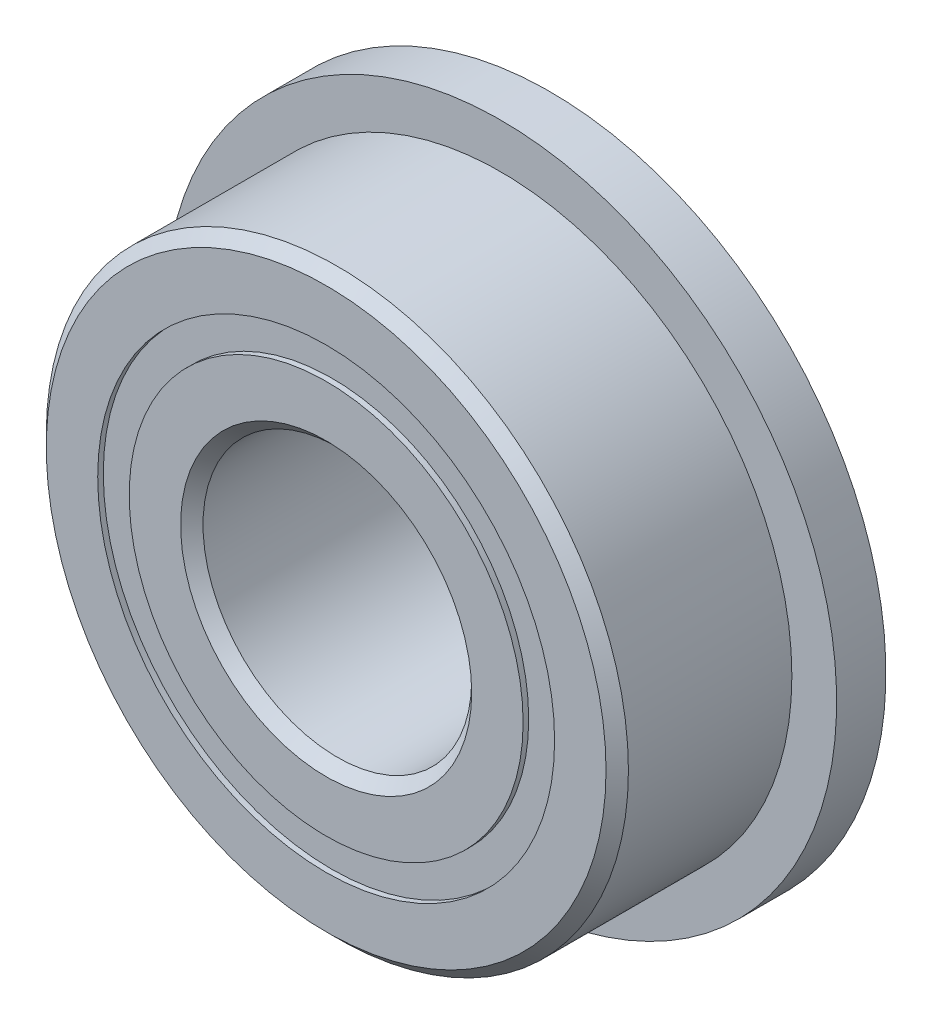
ISO-10303-21;
HEADER;
FILE_DESCRIPTION(('STEP AP214'),'2;1');
FILE_NAME('part.step','',(''),(''),'','','');
FILE_SCHEMA(('AUTOMOTIVE_DESIGN { 1 0 10303 214 1 1 1 1 }'));
ENDSEC;
DATA;
#1=APPLICATION_CONTEXT('core data for automotive mechanical design processes');
#2=APPLICATION_PROTOCOL_DEFINITION('international standard','automotive_design',2000,#1);
#3=PRODUCT_CONTEXT('',#1,'mechanical');
#4=PRODUCT('Part','Part','',(#3));
#5=PRODUCT_RELATED_PRODUCT_CATEGORY('part','',(#4));
#6=PRODUCT_DEFINITION_FORMATION('','',#4);
#7=PRODUCT_DEFINITION_CONTEXT('part definition',#1,'design');
#8=PRODUCT_DEFINITION('design','',#6,#7);
#9=PRODUCT_DEFINITION_SHAPE('','',#8);
#10=(LENGTH_UNIT() NAMED_UNIT(*) SI_UNIT(.MILLI.,.METRE.));
#11=(NAMED_UNIT(*) PLANE_ANGLE_UNIT() SI_UNIT($,.RADIAN.));
#12=(NAMED_UNIT(*) SI_UNIT($,.STERADIAN.) SOLID_ANGLE_UNIT());
#13=UNCERTAINTY_MEASURE_WITH_UNIT(LENGTH_MEASURE(1.E-05),#10,'distance_accuracy_value','');
#14=(GEOMETRIC_REPRESENTATION_CONTEXT(3) GLOBAL_UNCERTAINTY_ASSIGNED_CONTEXT((#13)) GLOBAL_UNIT_ASSIGNED_CONTEXT((#10,
#11,#12)) REPRESENTATION_CONTEXT('',''));
#15=CARTESIAN_POINT('',(0.,0.,0.));
#16=DIRECTION('',(0.,0.,1.));
#17=DIRECTION('',(1.,0.,0.));
#18=AXIS2_PLACEMENT_3D('',#15,#16,#17);
#19=CARTESIAN_POINT('',(0.,5.10164835164835,-2.375));
#20=DIRECTION('',(0.,0.,1.));
#21=DIRECTION('',(1.,0.,0.));
#22=AXIS2_PLACEMENT_3D('',#19,#20,#21);
#23=PLANE('',#22);
#24=CARTESIAN_POINT('',(0.,0.,-2.375));
#25=DIRECTION('',(0.,0.,1.));
#26=DIRECTION('',(1.,0.,0.));
#27=AXIS2_PLACEMENT_3D('',#24,#25,#26);
#28=CIRCLE('',#27,5.10164835164835);
#29=CARTESIAN_POINT('',(5.10164835164835,0.,-2.375));
#30=VERTEX_POINT('',#29);
#31=EDGE_CURVE('E57',#30,#30,#28,.T.);
#32=ORIENTED_EDGE('',*,*,#31,.F.);
#33=EDGE_LOOP('',(#32));
#34=FACE_BOUND('',#33,.T.);
#35=CARTESIAN_POINT('',(0.,0.,-2.375));
#36=DIRECTION('',(0.,0.,1.));
#37=DIRECTION('',(1.,0.,0.));
#38=AXIS2_PLACEMENT_3D('',#35,#36,#37);
#39=CIRCLE('',#38,4.39835164835165);
#40=CARTESIAN_POINT('',(4.39835164835165,0.,-2.375));
#41=VERTEX_POINT('',#40);
#42=EDGE_CURVE('E11',#41,#41,#39,.T.);
#43=ORIENTED_EDGE('',*,*,#42,.T.);
#44=EDGE_LOOP('',(#43));
#45=FACE_BOUND('',#44,.T.);
#46=ADVANCED_FACE('F43',(#34,#45),#23,.F.);
#47=CARTESIAN_POINT('',(0.,0.,2.5));
#48=DIRECTION('',(0.,0.,1.));
#49=DIRECTION('',(1.,0.,0.));
#50=AXIS2_PLACEMENT_3D('',#47,#48,#49);
#51=CYLINDRICAL_SURFACE('',#50,4.39835164835165);
#52=ORIENTED_EDGE('',*,*,#42,.F.);
#53=EDGE_LOOP('',(#52));
#54=FACE_BOUND('',#53,.T.);
#55=CARTESIAN_POINT('',(0.,0.,-1.16542887575844));
#56=DIRECTION('',(0.,0.,1.));
#57=DIRECTION('',(1.,0.,0.));
#58=AXIS2_PLACEMENT_3D('',#55,#56,#57);
#59=CIRCLE('',#58,4.39835164835165);
#60=CARTESIAN_POINT('',(4.39835164835165,0.,-1.16542887575844));
#61=VERTEX_POINT('',#60);
#62=EDGE_CURVE('E49',#61,#61,#59,.T.);
#63=ORIENTED_EDGE('',*,*,#62,.T.);
#64=EDGE_LOOP('',(#63));
#65=FACE_BOUND('',#64,.T.);
#66=ADVANCED_FACE('F66',(#54,#65),#51,.F.);
#67=CARTESIAN_POINT('',(0.,5.10164835164835,-1.16542887575844));
#68=DIRECTION('',(0.,0.,-1.));
#69=DIRECTION('',(-1.,0.,0.));
#70=AXIS2_PLACEMENT_3D('',#67,#68,#69);
#71=PLANE('',#70);
#72=ORIENTED_EDGE('',*,*,#62,.F.);
#73=EDGE_LOOP('',(#72));
#74=FACE_BOUND('',#73,.T.);
#75=CARTESIAN_POINT('',(0.,0.,-1.16542887575844));
#76=DIRECTION('',(0.,0.,1.));
#77=DIRECTION('',(1.,0.,0.));
#78=AXIS2_PLACEMENT_3D('',#75,#76,#77);
#79=CIRCLE('',#78,5.10164835164835);
#80=CARTESIAN_POINT('',(5.10164835164835,0.,-1.16542887575844));
#81=VERTEX_POINT('',#80);
#82=EDGE_CURVE('E53',#81,#81,#79,.T.);
#83=ORIENTED_EDGE('',*,*,#82,.T.);
#84=EDGE_LOOP('',(#83));
#85=FACE_BOUND('',#84,.T.);
#86=ADVANCED_FACE('F70',(#74,#85),#71,.F.);
#87=CARTESIAN_POINT('',(0.,0.,2.5));
#88=DIRECTION('',(0.,0.,1.));
#89=DIRECTION('',(1.,0.,0.));
#90=AXIS2_PLACEMENT_3D('',#87,#88,#89);
#91=CYLINDRICAL_SURFACE('',#90,5.10164835164835);
#92=ORIENTED_EDGE('',*,*,#82,.F.);
#93=EDGE_LOOP('',(#92));
#94=FACE_BOUND('',#93,.T.);
#95=ORIENTED_EDGE('',*,*,#31,.T.);
#96=EDGE_LOOP('',(#95));
#97=FACE_BOUND('',#96,.T.);
#98=ADVANCED_FACE('F63',(#94,#97),#91,.T.);
#99=CLOSED_SHELL('',(#46,#66,#86,#98));
#100=MANIFOLD_SOLID_BREP('B2',#99);
#101=CARTESIAN_POINT('',(0.,5.10164835164835,2.375));
#102=DIRECTION('',(0.,0.,-1.));
#103=DIRECTION('',(-1.,0.,0.));
#104=AXIS2_PLACEMENT_3D('',#101,#102,#103);
#105=PLANE('',#104);
#106=CARTESIAN_POINT('',(0.,0.,2.375));
#107=DIRECTION('',(0.,0.,1.));
#108=DIRECTION('',(1.,0.,0.));
#109=AXIS2_PLACEMENT_3D('',#106,#107,#108);
#110=CIRCLE('',#109,4.39835164835165);
#111=CARTESIAN_POINT('',(4.39835164835165,0.,2.375));
#112=VERTEX_POINT('',#111);
#113=EDGE_CURVE('E42',#112,#112,#110,.T.);
#114=ORIENTED_EDGE('',*,*,#113,.F.);
#115=EDGE_LOOP('',(#114));
#116=FACE_BOUND('',#115,.T.);
#117=CARTESIAN_POINT('',(0.,0.,2.375));
#118=DIRECTION('',(0.,0.,1.));
#119=DIRECTION('',(1.,0.,0.));
#120=AXIS2_PLACEMENT_3D('',#117,#118,#119);
#121=CIRCLE('',#120,5.10164835164835);
#122=CARTESIAN_POINT('',(5.10164835164835,0.,2.375));
#123=VERTEX_POINT('',#122);
#124=EDGE_CURVE('E124',#123,#123,#121,.T.);
#125=ORIENTED_EDGE('',*,*,#124,.T.);
#126=EDGE_LOOP('',(#125));
#127=FACE_BOUND('',#126,.T.);
#128=ADVANCED_FACE('F110',(#116,#127),#105,.F.);
#129=CARTESIAN_POINT('',(0.,0.,2.5));
#130=DIRECTION('',(0.,0.,1.));
#131=DIRECTION('',(1.,0.,0.));
#132=AXIS2_PLACEMENT_3D('',#129,#130,#131);
#133=CYLINDRICAL_SURFACE('',#132,4.39835164835165);
#134=CARTESIAN_POINT('',(0.,0.,1.16542887575844));
#135=DIRECTION('',(0.,0.,1.));
#136=DIRECTION('',(1.,0.,0.));
#137=AXIS2_PLACEMENT_3D('',#134,#135,#136);
#138=CIRCLE('',#137,4.39835164835165);
#139=CARTESIAN_POINT('',(4.39835164835165,0.,1.16542887575844));
#140=VERTEX_POINT('',#139);
#141=EDGE_CURVE('E116',#140,#140,#138,.T.);
#142=ORIENTED_EDGE('',*,*,#141,.F.);
#143=EDGE_LOOP('',(#142));
#144=FACE_BOUND('',#143,.T.);
#145=ORIENTED_EDGE('',*,*,#113,.T.);
#146=EDGE_LOOP('',(#145));
#147=FACE_BOUND('',#146,.T.);
#148=ADVANCED_FACE('F139',(#144,#147),#133,.F.);
#149=CARTESIAN_POINT('',(0.,5.10164835164835,1.16542887575844));
#150=DIRECTION('',(0.,0.,1.));
#151=DIRECTION('',(1.,0.,0.));
#152=AXIS2_PLACEMENT_3D('',#149,#150,#151);
#153=PLANE('',#152);
#154=CARTESIAN_POINT('',(0.,0.,1.16542887575844));
#155=DIRECTION('',(0.,0.,1.));
#156=DIRECTION('',(1.,0.,0.));
#157=AXIS2_PLACEMENT_3D('',#154,#155,#156);
#158=CIRCLE('',#157,5.10164835164835);
#159=CARTESIAN_POINT('',(5.10164835164835,0.,1.16542887575844));
#160=VERTEX_POINT('',#159);
#161=EDGE_CURVE('E120',#160,#160,#158,.T.);
#162=ORIENTED_EDGE('',*,*,#161,.F.);
#163=EDGE_LOOP('',(#162));
#164=FACE_BOUND('',#163,.T.);
#165=ORIENTED_EDGE('',*,*,#141,.T.);
#166=EDGE_LOOP('',(#165));
#167=FACE_BOUND('',#166,.T.);
#168=ADVANCED_FACE('F134',(#164,#167),#153,.F.);
#169=CARTESIAN_POINT('',(0.,0.,2.5));
#170=DIRECTION('',(0.,0.,1.));
#171=DIRECTION('',(1.,0.,0.));
#172=AXIS2_PLACEMENT_3D('',#169,#170,#171);
#173=CYLINDRICAL_SURFACE('',#172,5.10164835164835);
#174=ORIENTED_EDGE('',*,*,#124,.F.);
#175=EDGE_LOOP('',(#174));
#176=FACE_BOUND('',#175,.T.);
#177=ORIENTED_EDGE('',*,*,#161,.T.);
#178=EDGE_LOOP('',(#177));
#179=FACE_BOUND('',#178,.T.);
#180=ADVANCED_FACE('F131',(#176,#179),#173,.T.);
#181=CLOSED_SHELL('',(#128,#148,#168,#180));
#182=MANIFOLD_SOLID_BREP('B6',#181);
#183=CARTESIAN_POINT('',(-2.37499999999995,4.11362066797611,0.));
#184=DIRECTION('',(0.,0.,1.));
#185=DIRECTION('',(-0.499999999999989,0.866025403784445,0.));
#186=AXIS2_PLACEMENT_3D('',#183,#184,#185);
#187=SPHERICAL_SURFACE('',#186,1.16542887575844);
#188=CARTESIAN_POINT('',(-2.37499999999995,4.11362066797611,1.16542887575843));
#189=VERTEX_POINT('',#188);
#190=VERTEX_LOOP('',#189);
#191=FACE_BOUND('',#190,.T.);
#192=ADVANCED_FACE('F177',(#191),#187,.T.);
#193=CLOSED_SHELL('',(#192));
#194=MANIFOLD_SOLID_BREP('B37',#193);
#195=CARTESIAN_POINT('',(-4.11362066797606,2.37500000000005,0.));
#196=DIRECTION('',(0.,0.,1.));
#197=DIRECTION('',(-0.866025403784433,0.50000000000001,0.));
#198=AXIS2_PLACEMENT_3D('',#195,#196,#197);
#199=SPHERICAL_SURFACE('',#198,1.16542887575844);
#200=CARTESIAN_POINT('',(-4.11362066797606,2.37500000000005,1.16542887575843));
#201=VERTEX_POINT('',#200);
#202=VERTEX_LOOP('',#201);
#203=FACE_BOUND('',#202,.T.);
#204=ADVANCED_FACE('F197',(#203),#199,.T.);
#205=CLOSED_SHELL('',(#204));
#206=MANIFOLD_SOLID_BREP('B106',#205);
#207=CARTESIAN_POINT('',(-4.75,0.,0.));
#208=DIRECTION('',(0.,0.,1.));
#209=DIRECTION('',(-1.,0.,0.));
#210=AXIS2_PLACEMENT_3D('',#207,#208,#209);
#211=SPHERICAL_SURFACE('',#210,1.16542887575844);
#212=CARTESIAN_POINT('',(-4.75,0.,1.16542887575843));
#213=VERTEX_POINT('',#212);
#214=VERTEX_LOOP('',#213);
#215=FACE_BOUND('',#214,.T.);
#216=ADVANCED_FACE('F217',(#215),#211,.T.);
#217=CLOSED_SHELL('',(#216));
#218=MANIFOLD_SOLID_BREP('B173',#217);
#219=CARTESIAN_POINT('',(-4.1136206679761,-2.37499999999996,0.));
#220=DIRECTION('',(0.,0.,1.));
#221=DIRECTION('',(-0.866025403784443,-0.499999999999992,0.));
#222=AXIS2_PLACEMENT_3D('',#219,#220,#221);
#223=SPHERICAL_SURFACE('',#222,1.16542887575844);
#224=CARTESIAN_POINT('',(-4.1136206679761,-2.37499999999996,1.16542887575843));
#225=VERTEX_POINT('',#224);
#226=VERTEX_LOOP('',#225);
#227=FACE_BOUND('',#226,.T.);
#228=ADVANCED_FACE('F237',(#227),#223,.T.);
#229=CLOSED_SHELL('',(#228));
#230=MANIFOLD_SOLID_BREP('B193',#229);
#231=CARTESIAN_POINT('',(-2.37500000000003,-4.11362066797606,0.));
#232=DIRECTION('',(0.,0.,1.));
#233=DIRECTION('',(-0.500000000000007,-0.866025403784435,0.));
#234=AXIS2_PLACEMENT_3D('',#231,#232,#233);
#235=SPHERICAL_SURFACE('',#234,1.16542887575844);
#236=CARTESIAN_POINT('',(-2.37500000000003,-4.11362066797606,1.16542887575843));
#237=VERTEX_POINT('',#236);
#238=VERTEX_LOOP('',#237);
#239=FACE_BOUND('',#238,.T.);
#240=ADVANCED_FACE('F257',(#239),#235,.T.);
#241=CLOSED_SHELL('',(#240));
#242=MANIFOLD_SOLID_BREP('B213',#241);
#243=CARTESIAN_POINT('',(0.,-4.75,0.));
#244=DIRECTION('',(0.,0.,1.));
#245=DIRECTION('',(0.,-1.,0.));
#246=AXIS2_PLACEMENT_3D('',#243,#244,#245);
#247=SPHERICAL_SURFACE('',#246,1.16542887575844);
#248=CARTESIAN_POINT('',(0.,-4.75,1.16542887575843));
#249=VERTEX_POINT('',#248);
#250=VERTEX_LOOP('',#249);
#251=FACE_BOUND('',#250,.T.);
#252=ADVANCED_FACE('F277',(#251),#247,.T.);
#253=CLOSED_SHELL('',(#252));
#254=MANIFOLD_SOLID_BREP('B233',#253);
#255=CARTESIAN_POINT('',(2.37499999999998,-4.1136206679761,0.));
#256=DIRECTION('',(0.,0.,1.));
#257=DIRECTION('',(0.499999999999995,-0.866025403784442,0.));
#258=AXIS2_PLACEMENT_3D('',#255,#256,#257);
#259=SPHERICAL_SURFACE('',#258,1.16542887575844);
#260=CARTESIAN_POINT('',(2.37499999999998,-4.1136206679761,1.16542887575843));
#261=VERTEX_POINT('',#260);
#262=VERTEX_LOOP('',#261);
#263=FACE_BOUND('',#262,.T.);
#264=ADVANCED_FACE('F297',(#263),#259,.T.);
#265=CLOSED_SHELL('',(#264));
#266=MANIFOLD_SOLID_BREP('B253',#265);
#267=CARTESIAN_POINT('',(4.11362066797607,-2.37500000000002,0.));
#268=DIRECTION('',(0.,0.,1.));
#269=DIRECTION('',(0.866025403784436,-0.500000000000004,0.));
#270=AXIS2_PLACEMENT_3D('',#267,#268,#269);
#271=SPHERICAL_SURFACE('',#270,1.16542887575844);
#272=CARTESIAN_POINT('',(4.11362066797607,-2.37500000000002,1.16542887575843));
#273=VERTEX_POINT('',#272);
#274=VERTEX_LOOP('',#273);
#275=FACE_BOUND('',#274,.T.);
#276=ADVANCED_FACE('F317',(#275),#271,.T.);
#277=CLOSED_SHELL('',(#276));
#278=MANIFOLD_SOLID_BREP('B273',#277);
#279=CARTESIAN_POINT('',(4.75,0.,0.));
#280=DIRECTION('',(0.,0.,1.));
#281=DIRECTION('',(1.,0.,0.));
#282=AXIS2_PLACEMENT_3D('',#279,#280,#281);
#283=SPHERICAL_SURFACE('',#282,1.16542887575844);
#284=CARTESIAN_POINT('',(4.75,0.,1.16542887575843));
#285=VERTEX_POINT('',#284);
#286=VERTEX_LOOP('',#285);
#287=FACE_BOUND('',#286,.T.);
#288=ADVANCED_FACE('F337',(#287),#283,.T.);
#289=CLOSED_SHELL('',(#288));
#290=MANIFOLD_SOLID_BREP('B293',#289);
#291=CARTESIAN_POINT('',(4.11362066797609,2.37499999999999,0.));
#292=DIRECTION('',(0.,0.,1.));
#293=DIRECTION('',(0.86602540378444,0.499999999999998,0.));
#294=AXIS2_PLACEMENT_3D('',#291,#292,#293);
#295=SPHERICAL_SURFACE('',#294,1.16542887575844);
#296=CARTESIAN_POINT('',(4.11362066797609,2.37499999999999,1.16542887575843));
#297=VERTEX_POINT('',#296);
#298=VERTEX_LOOP('',#297);
#299=FACE_BOUND('',#298,.T.);
#300=ADVANCED_FACE('F357',(#299),#295,.T.);
#301=CLOSED_SHELL('',(#300));
#302=MANIFOLD_SOLID_BREP('B313',#301);
#303=CARTESIAN_POINT('',(2.375,4.11362066797608,0.));
#304=DIRECTION('',(0.,0.,1.));
#305=DIRECTION('',(0.500000000000001,0.866025403784438,0.));
#306=AXIS2_PLACEMENT_3D('',#303,#304,#305);
#307=SPHERICAL_SURFACE('',#306,1.16542887575844);
#308=CARTESIAN_POINT('',(2.375,4.11362066797608,1.16542887575843));
#309=VERTEX_POINT('',#308);
#310=VERTEX_LOOP('',#309);
#311=FACE_BOUND('',#310,.T.);
#312=ADVANCED_FACE('F377',(#311),#307,.T.);
#313=CLOSED_SHELL('',(#312));
#314=MANIFOLD_SOLID_BREP('B333',#313);
#315=CARTESIAN_POINT('',(0.,4.75,0.));
#316=DIRECTION('',(0.,0.,1.));
#317=DIRECTION('',(0.,1.,0.));
#318=AXIS2_PLACEMENT_3D('',#315,#316,#317);
#319=SPHERICAL_SURFACE('',#318,1.16542887575844);
#320=CARTESIAN_POINT('',(0.,4.75,1.16542887575843));
#321=VERTEX_POINT('',#320);
#322=VERTEX_LOOP('',#321);
#323=FACE_BOUND('',#322,.T.);
#324=ADVANCED_FACE('F399',(#323),#319,.T.);
#325=CLOSED_SHELL('',(#324));
#326=MANIFOLD_SOLID_BREP('B353',#325);
#327=CARTESIAN_POINT('',(0.,4.39835164835165,2.5));
#328=DIRECTION('',(0.,0.,-1.));
#329=DIRECTION('',(-1.,0.,0.));
#330=AXIS2_PLACEMENT_3D('',#327,#328,#329);
#331=PLANE('',#330);
#332=CARTESIAN_POINT('',(0.,0.,2.5));
#333=DIRECTION('',(0.,0.,1.));
#334=DIRECTION('',(1.,0.,0.));
#335=AXIS2_PLACEMENT_3D('',#332,#333,#334);
#336=CIRCLE('',#335,3.25);
#337=CARTESIAN_POINT('',(3.25,0.,2.5));
#338=VERTEX_POINT('',#337);
#339=EDGE_CURVE('E446',#338,#338,#336,.T.);
#340=ORIENTED_EDGE('',*,*,#339,.F.);
#341=EDGE_LOOP('',(#340));
#342=FACE_BOUND('',#341,.T.);
#343=CARTESIAN_POINT('',(0.,0.,2.5));
#344=DIRECTION('',(0.,0.,1.));
#345=DIRECTION('',(1.,0.,0.));
#346=AXIS2_PLACEMENT_3D('',#343,#344,#345);
#347=CIRCLE('',#346,4.39835164835165);
#348=CARTESIAN_POINT('',(4.39835164835165,0.,2.5));
#349=VERTEX_POINT('',#348);
#350=EDGE_CURVE('E398',#349,#349,#347,.T.);
#351=ORIENTED_EDGE('',*,*,#350,.T.);
#352=EDGE_LOOP('',(#351));
#353=FACE_BOUND('',#352,.T.);
#354=ADVANCED_FACE('F418',(#342,#353),#331,.F.);
#355=CARTESIAN_POINT('',(0.,0.,2.5));
#356=DIRECTION('',(0.,0.,1.));
#357=DIRECTION('',(1.,0.,0.));
#358=AXIS2_PLACEMENT_3D('',#355,#356,#357);
#359=CYLINDRICAL_SURFACE('',#358,4.39835164835165);
#360=ORIENTED_EDGE('',*,*,#350,.F.);
#361=EDGE_LOOP('',(#360));
#362=FACE_BOUND('',#361,.T.);
#363=CARTESIAN_POINT('',(0.,0.,1.11111111111111));
#364=DIRECTION('',(0.,0.,1.));
#365=DIRECTION('',(1.,0.,0.));
#366=AXIS2_PLACEMENT_3D('',#363,#364,#365);
#367=CIRCLE('',#366,4.39835164835165);
#368=CARTESIAN_POINT('',(4.39835164835165,0.,1.11111111111111));
#369=VERTEX_POINT('',#368);
#370=EDGE_CURVE('E424',#369,#369,#367,.T.);
#371=ORIENTED_EDGE('',*,*,#370,.T.);
#372=EDGE_LOOP('',(#371));
#373=FACE_BOUND('',#372,.T.);
#374=ADVANCED_FACE('F453',(#362,#373),#359,.T.);
#375=CARTESIAN_POINT('',(0.,0.,0.));
#376=DIRECTION('',(0.,0.,1.));
#377=DIRECTION('',(1.,0.,0.));
#378=AXIS2_PLACEMENT_3D('',#375,#376,#377);
#379=TOROIDAL_SURFACE('',#378,4.75,1.16542887575843);
#380=ORIENTED_EDGE('',*,*,#370,.F.);
#381=EDGE_LOOP('',(#380));
#382=FACE_BOUND('',#381,.T.);
#383=CARTESIAN_POINT('',(0.,0.,-1.11111111111111));
#384=DIRECTION('',(0.,0.,1.));
#385=DIRECTION('',(1.,0.,0.));
#386=AXIS2_PLACEMENT_3D('',#383,#384,#385);
#387=CIRCLE('',#386,4.39835164835165);
#388=CARTESIAN_POINT('',(4.39835164835165,0.,-1.11111111111111));
#389=VERTEX_POINT('',#388);
#390=EDGE_CURVE('E428',#389,#389,#387,.T.);
#391=ORIENTED_EDGE('',*,*,#390,.T.);
#392=EDGE_LOOP('',(#391));
#393=FACE_BOUND('',#392,.T.);
#394=ADVANCED_FACE('F457',(#382,#393),#379,.F.);
#395=CARTESIAN_POINT('',(0.,0.,2.5));
#396=DIRECTION('',(0.,0.,1.));
#397=DIRECTION('',(1.,0.,0.));
#398=AXIS2_PLACEMENT_3D('',#395,#396,#397);
#399=CYLINDRICAL_SURFACE('',#398,4.39835164835165);
#400=ORIENTED_EDGE('',*,*,#390,.F.);
#401=EDGE_LOOP('',(#400));
#402=FACE_BOUND('',#401,.T.);
#403=CARTESIAN_POINT('',(0.,0.,-2.5));
#404=DIRECTION('',(0.,0.,1.));
#405=DIRECTION('',(1.,0.,0.));
#406=AXIS2_PLACEMENT_3D('',#403,#404,#405);
#407=CIRCLE('',#406,4.39835164835165);
#408=CARTESIAN_POINT('',(4.39835164835165,0.,-2.5));
#409=VERTEX_POINT('',#408);
#410=EDGE_CURVE('E432',#409,#409,#407,.T.);
#411=ORIENTED_EDGE('',*,*,#410,.T.);
#412=EDGE_LOOP('',(#411));
#413=FACE_BOUND('',#412,.T.);
#414=ADVANCED_FACE('F462',(#402,#413),#399,.T.);
#415=CARTESIAN_POINT('',(0.,3.25,-2.5));
#416=DIRECTION('',(0.,0.,1.));
#417=DIRECTION('',(1.,0.,0.));
#418=AXIS2_PLACEMENT_3D('',#415,#416,#417);
#419=PLANE('',#418);
#420=ORIENTED_EDGE('',*,*,#410,.F.);
#421=EDGE_LOOP('',(#420));
#422=FACE_BOUND('',#421,.T.);
#423=CARTESIAN_POINT('',(0.,0.,-2.5));
#424=DIRECTION('',(0.,0.,1.));
#425=DIRECTION('',(1.,0.,0.));
#426=AXIS2_PLACEMENT_3D('',#423,#424,#425);
#427=CIRCLE('',#426,3.25);
#428=CARTESIAN_POINT('',(3.25,0.,-2.5));
#429=VERTEX_POINT('',#428);
#430=EDGE_CURVE('E437',#429,#429,#427,.T.);
#431=ORIENTED_EDGE('',*,*,#430,.T.);
#432=EDGE_LOOP('',(#431));
#433=FACE_BOUND('',#432,.T.);
#434=ADVANCED_FACE('F468',(#422,#433),#419,.F.);
#435=CARTESIAN_POINT('',(0.,0.,-2.25));
#436=DIRECTION('',(0.,0.,-1.));
#437=DIRECTION('',(-1.,0.,0.));
#438=AXIS2_PLACEMENT_3D('',#435,#436,#437);
#439=CONICAL_SURFACE('',#438,3.,0.785398163397442);
#440=ORIENTED_EDGE('',*,*,#430,.F.);
#441=EDGE_LOOP('',(#440));
#442=FACE_BOUND('',#441,.T.);
#443=CARTESIAN_POINT('',(0.,0.,-2.25));
#444=DIRECTION('',(0.,0.,1.));
#445=DIRECTION('',(1.,0.,0.));
#446=AXIS2_PLACEMENT_3D('',#443,#444,#445);
#447=CIRCLE('',#446,3.);
#448=CARTESIAN_POINT('',(3.,0.,-2.25));
#449=VERTEX_POINT('',#448);
#450=EDGE_CURVE('E440',#449,#449,#447,.T.);
#451=ORIENTED_EDGE('',*,*,#450,.T.);
#452=EDGE_LOOP('',(#451));
#453=FACE_BOUND('',#452,.T.);
#454=ADVANCED_FACE('F472',(#442,#453),#439,.F.);
#455=CARTESIAN_POINT('',(0.,0.,2.5));
#456=DIRECTION('',(0.,0.,1.));
#457=DIRECTION('',(1.,0.,0.));
#458=AXIS2_PLACEMENT_3D('',#455,#456,#457);
#459=CYLINDRICAL_SURFACE('',#458,3.);
#460=ORIENTED_EDGE('',*,*,#450,.F.);
#461=EDGE_LOOP('',(#460));
#462=FACE_BOUND('',#461,.T.);
#463=CARTESIAN_POINT('',(0.,0.,2.25));
#464=DIRECTION('',(0.,0.,1.));
#465=DIRECTION('',(1.,0.,0.));
#466=AXIS2_PLACEMENT_3D('',#463,#464,#465);
#467=CIRCLE('',#466,3.);
#468=CARTESIAN_POINT('',(3.,0.,2.25));
#469=VERTEX_POINT('',#468);
#470=EDGE_CURVE('E443',#469,#469,#467,.T.);
#471=ORIENTED_EDGE('',*,*,#470,.T.);
#472=EDGE_LOOP('',(#471));
#473=FACE_BOUND('',#472,.T.);
#474=ADVANCED_FACE('F476',(#462,#473),#459,.F.);
#475=CARTESIAN_POINT('',(0.,0.,2.5));
#476=DIRECTION('',(0.,0.,1.));
#477=DIRECTION('',(1.,0.,0.));
#478=AXIS2_PLACEMENT_3D('',#475,#476,#477);
#479=CONICAL_SURFACE('',#478,3.25,0.785398163397457);
#480=ORIENTED_EDGE('',*,*,#470,.F.);
#481=EDGE_LOOP('',(#480));
#482=FACE_BOUND('',#481,.T.);
#483=ORIENTED_EDGE('',*,*,#339,.T.);
#484=EDGE_LOOP('',(#483));
#485=FACE_BOUND('',#484,.T.);
#486=ADVANCED_FACE('F450',(#482,#485),#479,.F.);
#487=CLOSED_SHELL('',(#354,#374,#394,#414,#434,#454,#474,#486));
#488=MANIFOLD_SOLID_BREP('B373',#487);
#489=CARTESIAN_POINT('',(0.,0.,2.25));
#490=DIRECTION('',(0.,0.,-1.));
#491=DIRECTION('',(-1.,0.,0.));
#492=AXIS2_PLACEMENT_3D('',#489,#490,#491);
#493=CONICAL_SURFACE('',#492,6.5,0.785398163397446);
#494=CARTESIAN_POINT('',(0.,0.,2.5));
#495=DIRECTION('',(0.,0.,1.));
#496=DIRECTION('',(1.,0.,0.));
#497=AXIS2_PLACEMENT_3D('',#494,#495,#496);
#498=CIRCLE('',#497,6.25);
#499=CARTESIAN_POINT('',(6.25,0.,2.5));
#500=VERTEX_POINT('',#499);
#501=EDGE_CURVE('E561',#500,#500,#498,.T.);
#502=ORIENTED_EDGE('',*,*,#501,.F.);
#503=EDGE_LOOP('',(#502));
#504=FACE_BOUND('',#503,.T.);
#505=CARTESIAN_POINT('',(0.,0.,2.25));
#506=DIRECTION('',(0.,0.,1.));
#507=DIRECTION('',(1.,0.,0.));
#508=AXIS2_PLACEMENT_3D('',#505,#506,#507);
#509=CIRCLE('',#508,6.5);
#510=CARTESIAN_POINT('',(6.5,0.,2.25));
#511=VERTEX_POINT('',#510);
#512=EDGE_CURVE('E417',#511,#511,#509,.T.);
#513=ORIENTED_EDGE('',*,*,#512,.T.);
#514=EDGE_LOOP('',(#513));
#515=FACE_BOUND('',#514,.T.);
#516=ADVANCED_FACE('F539',(#504,#515),#493,.T.);
#517=CARTESIAN_POINT('',(0.,0.,2.5));
#518=DIRECTION('',(0.,0.,1.));
#519=DIRECTION('',(1.,0.,0.));
#520=AXIS2_PLACEMENT_3D('',#517,#518,#519);
#521=CYLINDRICAL_SURFACE('',#520,6.5);
#522=CARTESIAN_POINT('',(0.,0.,-1.4));
#523=DIRECTION('',(0.,0.,1.));
#524=DIRECTION('',(1.,0.,0.));
#525=AXIS2_PLACEMENT_3D('',#522,#523,#524);
#526=CIRCLE('',#525,6.5);
#527=CARTESIAN_POINT('',(6.5,0.,-1.4));
#528=VERTEX_POINT('',#527);
#529=EDGE_CURVE('E564',#528,#528,#526,.T.);
#530=ORIENTED_EDGE('',*,*,#529,.T.);
#531=EDGE_LOOP('',(#530));
#532=FACE_BOUND('',#531,.T.);
#533=ORIENTED_EDGE('',*,*,#512,.F.);
#534=EDGE_LOOP('',(#533));
#535=FACE_BOUND('',#534,.T.);
#536=ADVANCED_FACE('F584',(#532,#535),#521,.T.);
#537=CARTESIAN_POINT('',(0.,6.25,-2.5));
#538=DIRECTION('',(0.,0.,1.));
#539=DIRECTION('',(1.,0.,0.));
#540=AXIS2_PLACEMENT_3D('',#537,#538,#539);
#541=PLANE('',#540);
#542=CARTESIAN_POINT('',(0.,0.,-2.5));
#543=DIRECTION('',(0.,0.,1.));
#544=DIRECTION('',(1.,0.,0.));
#545=AXIS2_PLACEMENT_3D('',#542,#543,#544);
#546=CIRCLE('',#545,5.10164835164835);
#547=CARTESIAN_POINT('',(5.10164835164835,0.,-2.5));
#548=VERTEX_POINT('',#547);
#549=EDGE_CURVE('E545',#548,#548,#546,.T.);
#550=ORIENTED_EDGE('',*,*,#549,.T.);
#551=EDGE_LOOP('',(#550));
#552=FACE_BOUND('',#551,.T.);
#553=CARTESIAN_POINT('',(0.,0.,-2.5));
#554=DIRECTION('',(0.,0.,-1.));
#555=DIRECTION('',(-1.,0.,0.));
#556=AXIS2_PLACEMENT_3D('',#553,#554,#555);
#557=CIRCLE('',#556,7.5);
#558=CARTESIAN_POINT('',(-7.5,0.,-2.5));
#559=VERTEX_POINT('',#558);
#560=EDGE_CURVE('E567',#559,#559,#557,.T.);
#561=ORIENTED_EDGE('',*,*,#560,.T.);
#562=EDGE_LOOP('',(#561));
#563=FACE_BOUND('',#562,.T.);
#564=ADVANCED_FACE('F587',(#552,#563),#541,.F.);
#565=CARTESIAN_POINT('',(0.,0.,2.5));
#566=DIRECTION('',(0.,0.,1.));
#567=DIRECTION('',(1.,0.,0.));
#568=AXIS2_PLACEMENT_3D('',#565,#566,#567);
#569=CYLINDRICAL_SURFACE('',#568,5.10164835164835);
#570=CARTESIAN_POINT('',(0.,0.,-1.11111111111111));
#571=DIRECTION('',(0.,0.,1.));
#572=DIRECTION('',(1.,0.,0.));
#573=AXIS2_PLACEMENT_3D('',#570,#571,#572);
#574=CIRCLE('',#573,5.10164835164835);
#575=CARTESIAN_POINT('',(5.10164835164835,0.,-1.11111111111111));
#576=VERTEX_POINT('',#575);
#577=EDGE_CURVE('E549',#576,#576,#574,.T.);
#578=ORIENTED_EDGE('',*,*,#577,.T.);
#579=EDGE_LOOP('',(#578));
#580=FACE_BOUND('',#579,.T.);
#581=ORIENTED_EDGE('',*,*,#549,.F.);
#582=EDGE_LOOP('',(#581));
#583=FACE_BOUND('',#582,.T.);
#584=ADVANCED_FACE('F592',(#580,#583),#569,.F.);
#585=CARTESIAN_POINT('',(0.,0.,0.));
#586=DIRECTION('',(0.,0.,1.));
#587=DIRECTION('',(1.,0.,0.));
#588=AXIS2_PLACEMENT_3D('',#585,#586,#587);
#589=TOROIDAL_SURFACE('',#588,4.75,1.16542887575844);
#590=ORIENTED_EDGE('',*,*,#577,.F.);
#591=EDGE_LOOP('',(#590));
#592=FACE_BOUND('',#591,.T.);
#593=CARTESIAN_POINT('',(0.,0.,1.11111111111111));
#594=DIRECTION('',(0.,0.,1.));
#595=DIRECTION('',(1.,0.,0.));
#596=AXIS2_PLACEMENT_3D('',#593,#594,#595);
#597=CIRCLE('',#596,5.10164835164835);
#598=CARTESIAN_POINT('',(5.10164835164835,0.,1.11111111111111));
#599=VERTEX_POINT('',#598);
#600=EDGE_CURVE('E553',#599,#599,#597,.T.);
#601=ORIENTED_EDGE('',*,*,#600,.T.);
#602=EDGE_LOOP('',(#601));
#603=FACE_BOUND('',#602,.T.);
#604=ADVANCED_FACE('F598',(#592,#603),#589,.F.);
#605=CARTESIAN_POINT('',(0.,0.,2.5));
#606=DIRECTION('',(0.,0.,1.));
#607=DIRECTION('',(1.,0.,0.));
#608=AXIS2_PLACEMENT_3D('',#605,#606,#607);
#609=CYLINDRICAL_SURFACE('',#608,5.10164835164835);
#610=ORIENTED_EDGE('',*,*,#600,.F.);
#611=EDGE_LOOP('',(#610));
#612=FACE_BOUND('',#611,.T.);
#613=CARTESIAN_POINT('',(0.,0.,2.5));
#614=DIRECTION('',(0.,0.,1.));
#615=DIRECTION('',(1.,0.,0.));
#616=AXIS2_PLACEMENT_3D('',#613,#614,#615);
#617=CIRCLE('',#616,5.10164835164835);
#618=CARTESIAN_POINT('',(5.10164835164835,0.,2.5));
#619=VERTEX_POINT('',#618);
#620=EDGE_CURVE('E558',#619,#619,#617,.T.);
#621=ORIENTED_EDGE('',*,*,#620,.T.);
#622=EDGE_LOOP('',(#621));
#623=FACE_BOUND('',#622,.T.);
#624=ADVANCED_FACE('F602',(#612,#623),#609,.F.);
#625=CARTESIAN_POINT('',(0.,6.25,2.5));
#626=DIRECTION('',(0.,0.,-1.));
#627=DIRECTION('',(-1.,0.,0.));
#628=AXIS2_PLACEMENT_3D('',#625,#626,#627);
#629=PLANE('',#628);
#630=ORIENTED_EDGE('',*,*,#620,.F.);
#631=EDGE_LOOP('',(#630));
#632=FACE_BOUND('',#631,.T.);
#633=ORIENTED_EDGE('',*,*,#501,.T.);
#634=EDGE_LOOP('',(#633));
#635=FACE_BOUND('',#634,.T.);
#636=ADVANCED_FACE('F580',(#632,#635),#629,.F.);
#637=CARTESIAN_POINT('',(0.,5.10164835164835,-1.4));
#638=DIRECTION('',(0.,0.,1.));
#639=DIRECTION('',(1.,0.,0.));
#640=AXIS2_PLACEMENT_3D('',#637,#638,#639);
#641=PLANE('',#640);
#642=CARTESIAN_POINT('',(0.,0.,-1.4));
#643=DIRECTION('',(0.,0.,-1.));
#644=DIRECTION('',(-1.,0.,0.));
#645=AXIS2_PLACEMENT_3D('',#642,#643,#644);
#646=CIRCLE('',#645,7.5);
#647=CARTESIAN_POINT('',(-7.5,0.,-1.4));
#648=VERTEX_POINT('',#647);
#649=EDGE_CURVE('E570',#648,#648,#646,.T.);
#650=ORIENTED_EDGE('',*,*,#649,.F.);
#651=EDGE_LOOP('',(#650));
#652=FACE_BOUND('',#651,.T.);
#653=ORIENTED_EDGE('',*,*,#529,.F.);
#654=EDGE_LOOP('',(#653));
#655=FACE_BOUND('',#654,.T.);
#656=ADVANCED_FACE('F577',(#652,#655),#641,.T.);
#657=CARTESIAN_POINT('',(0.,0.,-2.5));
#658=DIRECTION('',(0.,0.,-1.));
#659=DIRECTION('',(-1.,0.,0.));
#660=AXIS2_PLACEMENT_3D('',#657,#658,#659);
#661=CYLINDRICAL_SURFACE('',#660,7.5);
#662=ORIENTED_EDGE('',*,*,#649,.T.);
#663=EDGE_LOOP('',(#662));
#664=FACE_BOUND('',#663,.T.);
#665=ORIENTED_EDGE('',*,*,#560,.F.);
#666=EDGE_LOOP('',(#665));
#667=FACE_BOUND('',#666,.T.);
#668=ADVANCED_FACE('F574',(#664,#667),#661,.T.);
#669=CLOSED_SHELL('',(#516,#536,#564,#584,#604,#624,#636,#656,#668));
#670=MANIFOLD_SOLID_BREP('B393',#669);
#671=ADVANCED_BREP_SHAPE_REPRESENTATION('',(#18,#100,#182,#194,#206,#218,#230,#242,#254,#266,
#278,#290,#302,#314,#326,#488,#670),#14);
#672=SHAPE_DEFINITION_REPRESENTATION(#9,#671);
ENDSEC;
END-ISO-10303-21;
